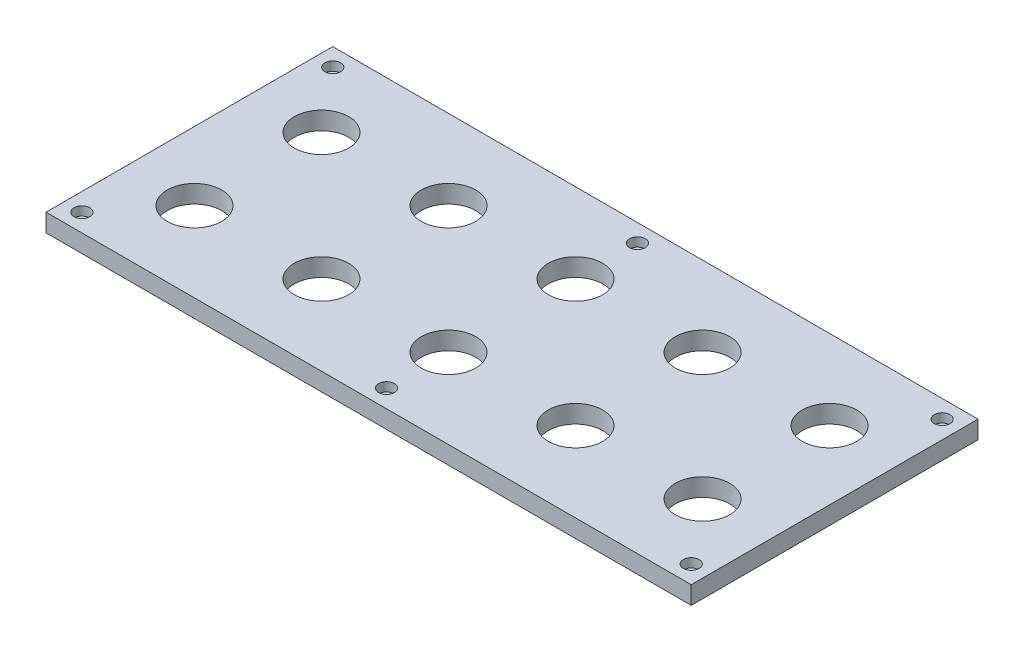
ISO-10303-21;
HEADER;
FILE_DESCRIPTION(('STEP AP214'),'2;1');
FILE_NAME('part.step','',(''),(''),'','','');
FILE_SCHEMA(('AUTOMOTIVE_DESIGN { 1 0 10303 214 1 1 1 1 }'));
ENDSEC;
DATA;
#1=APPLICATION_CONTEXT('core data for automotive mechanical design processes');
#2=APPLICATION_PROTOCOL_DEFINITION('international standard','automotive_design',2000,#1);
#3=PRODUCT_CONTEXT('',#1,'mechanical');
#4=PRODUCT('Part','Part','',(#3));
#5=PRODUCT_RELATED_PRODUCT_CATEGORY('part','',(#4));
#6=PRODUCT_DEFINITION_FORMATION('','',#4);
#7=PRODUCT_DEFINITION_CONTEXT('part definition',#1,'design');
#8=PRODUCT_DEFINITION('design','',#6,#7);
#9=PRODUCT_DEFINITION_SHAPE('','',#8);
#10=(LENGTH_UNIT() NAMED_UNIT(*) SI_UNIT(.MILLI.,.METRE.));
#11=(NAMED_UNIT(*) PLANE_ANGLE_UNIT() SI_UNIT($,.RADIAN.));
#12=(NAMED_UNIT(*) SI_UNIT($,.STERADIAN.) SOLID_ANGLE_UNIT());
#13=UNCERTAINTY_MEASURE_WITH_UNIT(LENGTH_MEASURE(1.E-05),#10,'distance_accuracy_value','');
#14=(GEOMETRIC_REPRESENTATION_CONTEXT(3) GLOBAL_UNCERTAINTY_ASSIGNED_CONTEXT((#13)) GLOBAL_UNIT_ASSIGNED_CONTEXT((#10,
#11,#12)) REPRESENTATION_CONTEXT('',''));
#15=CARTESIAN_POINT('',(0.,0.,0.));
#16=DIRECTION('',(0.,0.,1.));
#17=DIRECTION('',(1.,0.,0.));
#18=AXIS2_PLACEMENT_3D('',#15,#16,#17);
#19=CARTESIAN_POINT('',(0.,0.,0.));
#20=DIRECTION('',(0.,-1.,0.));
#21=DIRECTION('',(0.,0.,-1.));
#22=AXIS2_PLACEMENT_3D('',#19,#20,#21);
#23=PLANE('',#22);
#24=CARTESIAN_POINT('',(0.,0.,88.9));
#25=DIRECTION('',(0.,1.,0.));
#26=DIRECTION('',(0.,0.,1.));
#27=AXIS2_PLACEMENT_3D('',#24,#25,#26);
#28=CIRCLE('',#27,5.55625);
#29=CARTESIAN_POINT('',(0.,0.,94.45625));
#30=VERTEX_POINT('',#29);
#31=EDGE_CURVE('E258',#30,#30,#28,.T.);
#32=ORIENTED_EDGE('',*,*,#31,.F.);
#33=EDGE_LOOP('',(#32));
#34=FACE_BOUND('',#33,.T.);
#35=CARTESIAN_POINT('',(215.9,0.,-88.9));
#36=DIRECTION('',(0.,1.,0.));
#37=DIRECTION('',(0.,0.,1.));
#38=AXIS2_PLACEMENT_3D('',#35,#36,#37);
#39=CIRCLE('',#38,5.55624999999998);
#40=CARTESIAN_POINT('',(215.9,0.,-83.3437500000001));
#41=VERTEX_POINT('',#40);
#42=EDGE_CURVE('E282',#41,#41,#39,.T.);
#43=ORIENTED_EDGE('',*,*,#42,.F.);
#44=EDGE_LOOP('',(#43));
#45=FACE_BOUND('',#44,.T.);
#46=CARTESIAN_POINT('',(-215.9,0.,-88.9));
#47=DIRECTION('',(0.,1.,0.));
#48=DIRECTION('',(0.,0.,1.));
#49=AXIS2_PLACEMENT_3D('',#46,#47,#48);
#50=CIRCLE('',#49,5.55624999999998);
#51=CARTESIAN_POINT('',(-215.9,0.,-83.3437500000001));
#52=VERTEX_POINT('',#51);
#53=EDGE_CURVE('E306',#52,#52,#50,.T.);
#54=ORIENTED_EDGE('',*,*,#53,.F.);
#55=EDGE_LOOP('',(#54));
#56=FACE_BOUND('',#55,.T.);
#57=CARTESIAN_POINT('',(180.,0.,-45.));
#58=DIRECTION('',(0.,1.,0.));
#59=DIRECTION('',(0.,0.,1.));
#60=AXIS2_PLACEMENT_3D('',#57,#58,#59);
#61=CIRCLE('',#60,19.304);
#62=CARTESIAN_POINT('',(180.,0.,-25.696));
#63=VERTEX_POINT('',#62);
#64=EDGE_CURVE('E344',#63,#63,#61,.T.);
#65=ORIENTED_EDGE('',*,*,#64,.F.);
#66=EDGE_LOOP('',(#65));
#67=FACE_BOUND('',#66,.T.);
#68=CARTESIAN_POINT('',(90.,0.,-44.9999999999999));
#69=DIRECTION('',(0.,1.,0.));
#70=DIRECTION('',(0.,0.,1.));
#71=AXIS2_PLACEMENT_3D('',#68,#69,#70);
#72=CIRCLE('',#71,19.304);
#73=CARTESIAN_POINT('',(90.,0.,-25.6959999999999));
#74=VERTEX_POINT('',#73);
#75=EDGE_CURVE('E338',#74,#74,#72,.T.);
#76=ORIENTED_EDGE('',*,*,#75,.F.);
#77=EDGE_LOOP('',(#76));
#78=FACE_BOUND('',#77,.T.);
#79=CARTESIAN_POINT('',(90.,0.,45.));
#80=DIRECTION('',(0.,1.,0.));
#81=DIRECTION('',(0.,0.,1.));
#82=AXIS2_PLACEMENT_3D('',#79,#80,#81);
#83=CIRCLE('',#82,19.304);
#84=CARTESIAN_POINT('',(90.,0.,64.304));
#85=VERTEX_POINT('',#84);
#86=EDGE_CURVE('E332',#85,#85,#83,.T.);
#87=ORIENTED_EDGE('',*,*,#86,.F.);
#88=EDGE_LOOP('',(#87));
#89=FACE_BOUND('',#88,.T.);
#90=CARTESIAN_POINT('',(0.,0.,45.));
#91=DIRECTION('',(0.,1.,0.));
#92=DIRECTION('',(0.,0.,1.));
#93=AXIS2_PLACEMENT_3D('',#90,#91,#92);
#94=CIRCLE('',#93,19.304);
#95=CARTESIAN_POINT('',(0.,0.,64.304));
#96=VERTEX_POINT('',#95);
#97=EDGE_CURVE('E325',#96,#96,#94,.T.);
#98=ORIENTED_EDGE('',*,*,#97,.F.);
#99=EDGE_LOOP('',(#98));
#100=FACE_BOUND('',#99,.T.);
#101=CARTESIAN_POINT('',(-90.,0.,45.));
#102=DIRECTION('',(0.,1.,0.));
#103=DIRECTION('',(0.,0.,1.));
#104=AXIS2_PLACEMENT_3D('',#101,#102,#103);
#105=CIRCLE('',#104,19.304);
#106=CARTESIAN_POINT('',(-90.,0.,64.304));
#107=VERTEX_POINT('',#106);
#108=EDGE_CURVE('E368',#107,#107,#105,.T.);
#109=ORIENTED_EDGE('',*,*,#108,.F.);
#110=EDGE_LOOP('',(#109));
#111=FACE_BOUND('',#110,.T.);
#112=CARTESIAN_POINT('',(-180.,0.,45.));
#113=DIRECTION('',(0.,1.,0.));
#114=DIRECTION('',(0.,0.,1.));
#115=AXIS2_PLACEMENT_3D('',#112,#113,#114);
#116=CIRCLE('',#115,19.304);
#117=CARTESIAN_POINT('',(-180.,0.,64.304));
#118=VERTEX_POINT('',#117);
#119=EDGE_CURVE('E362',#118,#118,#116,.T.);
#120=ORIENTED_EDGE('',*,*,#119,.F.);
#121=EDGE_LOOP('',(#120));
#122=FACE_BOUND('',#121,.T.);
#123=CARTESIAN_POINT('',(0.,0.,-45.));
#124=DIRECTION('',(0.,1.,0.));
#125=DIRECTION('',(0.,0.,1.));
#126=AXIS2_PLACEMENT_3D('',#123,#124,#125);
#127=CIRCLE('',#126,19.304);
#128=CARTESIAN_POINT('',(0.,0.,-25.696));
#129=VERTEX_POINT('',#128);
#130=EDGE_CURVE('E356',#129,#129,#127,.T.);
#131=ORIENTED_EDGE('',*,*,#130,.F.);
#132=EDGE_LOOP('',(#131));
#133=FACE_BOUND('',#132,.T.);
#134=CARTESIAN_POINT('',(-90.,0.,-44.9999999999999));
#135=DIRECTION('',(0.,1.,0.));
#136=DIRECTION('',(0.,0.,1.));
#137=AXIS2_PLACEMENT_3D('',#134,#135,#136);
#138=CIRCLE('',#137,19.304);
#139=CARTESIAN_POINT('',(-90.,0.,-25.6959999999999));
#140=VERTEX_POINT('',#139);
#141=EDGE_CURVE('E349',#140,#140,#138,.T.);
#142=ORIENTED_EDGE('',*,*,#141,.F.);
#143=EDGE_LOOP('',(#142));
#144=FACE_BOUND('',#143,.T.);
#145=CARTESIAN_POINT('',(180.,0.,45.));
#146=DIRECTION('',(0.,1.,0.));
#147=DIRECTION('',(0.,0.,1.));
#148=AXIS2_PLACEMENT_3D('',#145,#146,#147);
#149=CIRCLE('',#148,19.304);
#150=CARTESIAN_POINT('',(180.,0.,64.304));
#151=VERTEX_POINT('',#150);
#152=EDGE_CURVE('E319',#151,#151,#149,.T.);
#153=ORIENTED_EDGE('',*,*,#152,.F.);
#154=EDGE_LOOP('',(#153));
#155=FACE_BOUND('',#154,.T.);
#156=CARTESIAN_POINT('',(-180.,0.,-45.));
#157=DIRECTION('',(0.,1.,0.));
#158=DIRECTION('',(0.,0.,1.));
#159=AXIS2_PLACEMENT_3D('',#156,#157,#158);
#160=CIRCLE('',#159,19.304);
#161=CARTESIAN_POINT('',(-180.,0.,-25.696));
#162=VERTEX_POINT('',#161);
#163=EDGE_CURVE('E102',#162,#162,#160,.T.);
#164=ORIENTED_EDGE('',*,*,#163,.F.);
#165=EDGE_LOOP('',(#164));
#166=FACE_BOUND('',#165,.T.);
#167=DIRECTION('',(0.,0.,1.));
#168=VECTOR('',#167,1.);
#169=CARTESIAN_POINT('',(-228.6,0.,-101.6));
#170=LINE('',#169,#168);
#171=CARTESIAN_POINT('',(-228.6,0.,-101.6));
#172=VERTEX_POINT('',#171);
#173=CARTESIAN_POINT('',(-228.6,0.,101.6));
#174=VERTEX_POINT('',#173);
#175=EDGE_CURVE('E98',#172,#174,#170,.T.);
#176=ORIENTED_EDGE('',*,*,#175,.T.);
#177=DIRECTION('',(1.,0.,0.));
#178=VECTOR('',#177,1.);
#179=CARTESIAN_POINT('',(228.6,0.,101.6));
#180=LINE('',#179,#178);
#181=CARTESIAN_POINT('',(228.6,0.,101.6));
#182=VERTEX_POINT('',#181);
#183=EDGE_CURVE('E101',#174,#182,#180,.T.);
#184=ORIENTED_EDGE('',*,*,#183,.T.);
#185=DIRECTION('',(0.,0.,-1.));
#186=VECTOR('',#185,1.);
#187=CARTESIAN_POINT('',(228.6,0.,-101.6));
#188=LINE('',#187,#186);
#189=CARTESIAN_POINT('',(228.6,0.,-101.6));
#190=VERTEX_POINT('',#189);
#191=EDGE_CURVE('E83',#182,#190,#188,.T.);
#192=ORIENTED_EDGE('',*,*,#191,.T.);
#193=DIRECTION('',(-1.,0.,0.));
#194=VECTOR('',#193,1.);
#195=CARTESIAN_POINT('',(228.6,0.,-101.6));
#196=LINE('',#195,#194);
#197=EDGE_CURVE('E93',#190,#172,#196,.T.);
#198=ORIENTED_EDGE('',*,*,#197,.T.);
#199=EDGE_LOOP('',(#176,#184,#192,#198));
#200=FACE_BOUND('',#199,.T.);
#201=CARTESIAN_POINT('',(0.,0.,-88.8999999999999));
#202=DIRECTION('',(0.,1.,0.));
#203=DIRECTION('',(0.,0.,1.));
#204=AXIS2_PLACEMENT_3D('',#201,#202,#203);
#205=CIRCLE('',#204,5.55625);
#206=CARTESIAN_POINT('',(0.,0.,-83.34375));
#207=VERTEX_POINT('',#206);
#208=EDGE_CURVE('E294',#207,#207,#205,.T.);
#209=ORIENTED_EDGE('',*,*,#208,.F.);
#210=EDGE_LOOP('',(#209));
#211=FACE_BOUND('',#210,.T.);
#212=CARTESIAN_POINT('',(215.9,0.,88.9));
#213=DIRECTION('',(0.,1.,0.));
#214=DIRECTION('',(0.,0.,1.));
#215=AXIS2_PLACEMENT_3D('',#212,#213,#214);
#216=CIRCLE('',#215,5.55624999999998);
#217=CARTESIAN_POINT('',(215.9,0.,94.45625));
#218=VERTEX_POINT('',#217);
#219=EDGE_CURVE('E270',#218,#218,#216,.T.);
#220=ORIENTED_EDGE('',*,*,#219,.F.);
#221=EDGE_LOOP('',(#220));
#222=FACE_BOUND('',#221,.T.);
#223=CARTESIAN_POINT('',(-215.9,0.,88.9));
#224=DIRECTION('',(0.,1.,0.));
#225=DIRECTION('',(0.,0.,1.));
#226=AXIS2_PLACEMENT_3D('',#223,#224,#225);
#227=CIRCLE('',#226,5.55624999999998);
#228=CARTESIAN_POINT('',(-215.9,0.,94.45625));
#229=VERTEX_POINT('',#228);
#230=EDGE_CURVE('E247',#229,#229,#227,.T.);
#231=ORIENTED_EDGE('',*,*,#230,.F.);
#232=EDGE_LOOP('',(#231));
#233=FACE_BOUND('',#232,.T.);
#234=ADVANCED_FACE('F32',(#34,#45,#56,#67,#78,#89,#100,#111,#122,#133,#144,#155,#166,#200,#211,
#222,#233),#23,.F.);
#235=CARTESIAN_POINT('',(-228.6,-12.7,-101.6));
#236=DIRECTION('',(-1.,0.,0.));
#237=DIRECTION('',(0.,0.,1.));
#238=AXIS2_PLACEMENT_3D('',#235,#236,#237);
#239=PLANE('',#238);
#240=ORIENTED_EDGE('',*,*,#175,.F.);
#241=DIRECTION('',(0.,1.,0.));
#242=VECTOR('',#241,1.);
#243=CARTESIAN_POINT('',(-228.6,-12.7,-101.6));
#244=LINE('',#243,#242);
#245=CARTESIAN_POINT('',(-228.6,-12.7,-101.6));
#246=VERTEX_POINT('',#245);
#247=EDGE_CURVE('E11',#246,#172,#244,.T.);
#248=ORIENTED_EDGE('',*,*,#247,.F.);
#249=DIRECTION('',(0.,0.,1.));
#250=VECTOR('',#249,1.);
#251=CARTESIAN_POINT('',(-228.6,-12.7,-101.6));
#252=LINE('',#251,#250);
#253=CARTESIAN_POINT('',(-228.6,-12.7,101.6));
#254=VERTEX_POINT('',#253);
#255=EDGE_CURVE('E91',#246,#254,#252,.T.);
#256=ORIENTED_EDGE('',*,*,#255,.T.);
#257=DIRECTION('',(0.,1.,0.));
#258=VECTOR('',#257,1.);
#259=CARTESIAN_POINT('',(-228.6,-12.7,101.6));
#260=LINE('',#259,#258);
#261=EDGE_CURVE('E36',#254,#174,#260,.T.);
#262=ORIENTED_EDGE('',*,*,#261,.T.);
#263=EDGE_LOOP('',(#240,#248,#256,#262));
#264=FACE_BOUND('',#263,.T.);
#265=ADVANCED_FACE('F34',(#264),#239,.T.);
#266=CARTESIAN_POINT('',(228.6,-12.7,-101.6));
#267=DIRECTION('',(0.,0.,-1.));
#268=DIRECTION('',(-1.,0.,0.));
#269=AXIS2_PLACEMENT_3D('',#266,#267,#268);
#270=PLANE('',#269);
#271=ORIENTED_EDGE('',*,*,#197,.F.);
#272=DIRECTION('',(0.,1.,0.));
#273=VECTOR('',#272,1.);
#274=CARTESIAN_POINT('',(228.6,-12.7,-101.6));
#275=LINE('',#274,#273);
#276=CARTESIAN_POINT('',(228.6,-12.7,-101.6));
#277=VERTEX_POINT('',#276);
#278=EDGE_CURVE('E42',#277,#190,#275,.T.);
#279=ORIENTED_EDGE('',*,*,#278,.F.);
#280=DIRECTION('',(-1.,0.,0.));
#281=VECTOR('',#280,1.);
#282=CARTESIAN_POINT('',(228.6,-12.7,-101.6));
#283=LINE('',#282,#281);
#284=EDGE_CURVE('E88',#277,#246,#283,.T.);
#285=ORIENTED_EDGE('',*,*,#284,.T.);
#286=ORIENTED_EDGE('',*,*,#247,.T.);
#287=EDGE_LOOP('',(#271,#279,#285,#286));
#288=FACE_BOUND('',#287,.T.);
#289=ADVANCED_FACE('F109',(#288),#270,.T.);
#290=CARTESIAN_POINT('',(228.6,-12.7,-101.6));
#291=DIRECTION('',(1.,0.,0.));
#292=DIRECTION('',(0.,0.,-1.));
#293=AXIS2_PLACEMENT_3D('',#290,#291,#292);
#294=PLANE('',#293);
#295=ORIENTED_EDGE('',*,*,#191,.F.);
#296=DIRECTION('',(0.,1.,0.));
#297=VECTOR('',#296,1.);
#298=CARTESIAN_POINT('',(228.6,-12.7,101.6));
#299=LINE('',#298,#297);
#300=CARTESIAN_POINT('',(228.6,-12.7,101.6));
#301=VERTEX_POINT('',#300);
#302=EDGE_CURVE('E78',#301,#182,#299,.T.);
#303=ORIENTED_EDGE('',*,*,#302,.F.);
#304=DIRECTION('',(0.,0.,-1.));
#305=VECTOR('',#304,1.);
#306=CARTESIAN_POINT('',(228.6,-12.7,-101.6));
#307=LINE('',#306,#305);
#308=EDGE_CURVE('E81',#301,#277,#307,.T.);
#309=ORIENTED_EDGE('',*,*,#308,.T.);
#310=ORIENTED_EDGE('',*,*,#278,.T.);
#311=EDGE_LOOP('',(#295,#303,#309,#310));
#312=FACE_BOUND('',#311,.T.);
#313=ADVANCED_FACE('F80',(#312),#294,.T.);
#314=CARTESIAN_POINT('',(228.6,-12.7,101.6));
#315=DIRECTION('',(0.,0.,1.));
#316=DIRECTION('',(1.,0.,0.));
#317=AXIS2_PLACEMENT_3D('',#314,#315,#316);
#318=PLANE('',#317);
#319=ORIENTED_EDGE('',*,*,#183,.F.);
#320=ORIENTED_EDGE('',*,*,#261,.F.);
#321=DIRECTION('',(1.,0.,0.));
#322=VECTOR('',#321,1.);
#323=CARTESIAN_POINT('',(228.6,-12.7,101.6));
#324=LINE('',#323,#322);
#325=EDGE_CURVE('E87',#254,#301,#324,.T.);
#326=ORIENTED_EDGE('',*,*,#325,.T.);
#327=ORIENTED_EDGE('',*,*,#302,.T.);
#328=EDGE_LOOP('',(#319,#320,#326,#327));
#329=FACE_BOUND('',#328,.T.);
#330=ADVANCED_FACE('F90',(#329),#318,.T.);
#331=CARTESIAN_POINT('',(0.,-12.7,0.));
#332=DIRECTION('',(0.,-1.,0.));
#333=DIRECTION('',(0.,0.,-1.));
#334=AXIS2_PLACEMENT_3D('',#331,#332,#333);
#335=PLANE('',#334);
#336=CARTESIAN_POINT('',(-215.9,-12.7,88.9));
#337=DIRECTION('',(0.,-1.,0.));
#338=DIRECTION('',(0.,0.,-1.));
#339=AXIS2_PLACEMENT_3D('',#336,#337,#338);
#340=CIRCLE('',#339,3.3782);
#341=CARTESIAN_POINT('',(-215.9,-12.7,85.5218));
#342=VERTEX_POINT('',#341);
#343=EDGE_CURVE('E255',#342,#342,#340,.T.);
#344=ORIENTED_EDGE('',*,*,#343,.F.);
#345=EDGE_LOOP('',(#344));
#346=FACE_BOUND('',#345,.T.);
#347=CARTESIAN_POINT('',(0.,-12.7,88.9));
#348=DIRECTION('',(0.,-1.,0.));
#349=DIRECTION('',(0.,0.,-1.));
#350=AXIS2_PLACEMENT_3D('',#347,#348,#349);
#351=CIRCLE('',#350,3.3782);
#352=CARTESIAN_POINT('',(0.,-12.7,85.5218));
#353=VERTEX_POINT('',#352);
#354=EDGE_CURVE('E267',#353,#353,#351,.T.);
#355=ORIENTED_EDGE('',*,*,#354,.F.);
#356=EDGE_LOOP('',(#355));
#357=FACE_BOUND('',#356,.T.);
#358=CARTESIAN_POINT('',(215.9,-12.7,88.9));
#359=DIRECTION('',(0.,-1.,0.));
#360=DIRECTION('',(0.,0.,-1.));
#361=AXIS2_PLACEMENT_3D('',#358,#359,#360);
#362=CIRCLE('',#361,3.3782);
#363=CARTESIAN_POINT('',(215.9,-12.7,85.5218));
#364=VERTEX_POINT('',#363);
#365=EDGE_CURVE('E279',#364,#364,#362,.T.);
#366=ORIENTED_EDGE('',*,*,#365,.F.);
#367=EDGE_LOOP('',(#366));
#368=FACE_BOUND('',#367,.T.);
#369=CARTESIAN_POINT('',(215.9,-12.7,-88.9));
#370=DIRECTION('',(0.,-1.,0.));
#371=DIRECTION('',(0.,0.,-1.));
#372=AXIS2_PLACEMENT_3D('',#369,#370,#371);
#373=CIRCLE('',#372,3.3782);
#374=CARTESIAN_POINT('',(215.9,-12.7,-92.2782));
#375=VERTEX_POINT('',#374);
#376=EDGE_CURVE('E291',#375,#375,#373,.T.);
#377=ORIENTED_EDGE('',*,*,#376,.F.);
#378=EDGE_LOOP('',(#377));
#379=FACE_BOUND('',#378,.T.);
#380=CARTESIAN_POINT('',(0.,-12.7,-88.8999999999999));
#381=DIRECTION('',(0.,-1.,0.));
#382=DIRECTION('',(0.,0.,-1.));
#383=AXIS2_PLACEMENT_3D('',#380,#381,#382);
#384=CIRCLE('',#383,3.3782);
#385=CARTESIAN_POINT('',(0.,-12.7,-92.2782));
#386=VERTEX_POINT('',#385);
#387=EDGE_CURVE('E303',#386,#386,#384,.T.);
#388=ORIENTED_EDGE('',*,*,#387,.F.);
#389=EDGE_LOOP('',(#388));
#390=FACE_BOUND('',#389,.T.);
#391=CARTESIAN_POINT('',(-215.9,-12.7,-88.9));
#392=DIRECTION('',(0.,-1.,0.));
#393=DIRECTION('',(0.,0.,-1.));
#394=AXIS2_PLACEMENT_3D('',#391,#392,#393);
#395=CIRCLE('',#394,3.3782);
#396=CARTESIAN_POINT('',(-215.9,-12.7,-92.2782));
#397=VERTEX_POINT('',#396);
#398=EDGE_CURVE('E315',#397,#397,#395,.T.);
#399=ORIENTED_EDGE('',*,*,#398,.F.);
#400=EDGE_LOOP('',(#399));
#401=FACE_BOUND('',#400,.T.);
#402=CARTESIAN_POINT('',(180.,-12.7,-45.));
#403=DIRECTION('',(0.,-1.,0.));
#404=DIRECTION('',(0.,0.,-1.));
#405=AXIS2_PLACEMENT_3D('',#402,#403,#404);
#406=CIRCLE('',#405,19.304);
#407=CARTESIAN_POINT('',(180.,-12.7,-64.304));
#408=VERTEX_POINT('',#407);
#409=EDGE_CURVE('E322',#408,#408,#406,.F.);
#410=ORIENTED_EDGE('',*,*,#409,.T.);
#411=EDGE_LOOP('',(#410));
#412=FACE_BOUND('',#411,.T.);
#413=CARTESIAN_POINT('',(90.,-12.7,-44.9999999999999));
#414=DIRECTION('',(0.,-1.,0.));
#415=DIRECTION('',(0.,0.,-1.));
#416=AXIS2_PLACEMENT_3D('',#413,#414,#415);
#417=CIRCLE('',#416,19.304);
#418=CARTESIAN_POINT('',(90.,-12.7,-64.3039999999999));
#419=VERTEX_POINT('',#418);
#420=EDGE_CURVE('E341',#419,#419,#417,.F.);
#421=ORIENTED_EDGE('',*,*,#420,.T.);
#422=EDGE_LOOP('',(#421));
#423=FACE_BOUND('',#422,.T.);
#424=CARTESIAN_POINT('',(90.,-12.7,45.));
#425=DIRECTION('',(0.,-1.,0.));
#426=DIRECTION('',(0.,0.,-1.));
#427=AXIS2_PLACEMENT_3D('',#424,#425,#426);
#428=CIRCLE('',#427,19.304);
#429=CARTESIAN_POINT('',(90.,-12.7,25.696));
#430=VERTEX_POINT('',#429);
#431=EDGE_CURVE('E335',#430,#430,#428,.F.);
#432=ORIENTED_EDGE('',*,*,#431,.T.);
#433=EDGE_LOOP('',(#432));
#434=FACE_BOUND('',#433,.T.);
#435=CARTESIAN_POINT('',(0.,-12.7,45.));
#436=DIRECTION('',(0.,-1.,0.));
#437=DIRECTION('',(0.,0.,-1.));
#438=AXIS2_PLACEMENT_3D('',#435,#436,#437);
#439=CIRCLE('',#438,19.304);
#440=CARTESIAN_POINT('',(0.,-12.7,25.696));
#441=VERTEX_POINT('',#440);
#442=EDGE_CURVE('E329',#441,#441,#439,.F.);
#443=ORIENTED_EDGE('',*,*,#442,.T.);
#444=EDGE_LOOP('',(#443));
#445=FACE_BOUND('',#444,.T.);
#446=CARTESIAN_POINT('',(-90.,-12.7,45.));
#447=DIRECTION('',(0.,-1.,0.));
#448=DIRECTION('',(0.,0.,-1.));
#449=AXIS2_PLACEMENT_3D('',#446,#447,#448);
#450=CIRCLE('',#449,19.304);
#451=CARTESIAN_POINT('',(-90.,-12.7,25.696));
#452=VERTEX_POINT('',#451);
#453=EDGE_CURVE('E328',#452,#452,#450,.F.);
#454=ORIENTED_EDGE('',*,*,#453,.T.);
#455=EDGE_LOOP('',(#454));
#456=FACE_BOUND('',#455,.T.);
#457=CARTESIAN_POINT('',(-180.,-12.7,45.));
#458=DIRECTION('',(0.,-1.,0.));
#459=DIRECTION('',(0.,0.,-1.));
#460=AXIS2_PLACEMENT_3D('',#457,#458,#459);
#461=CIRCLE('',#460,19.304);
#462=CARTESIAN_POINT('',(-180.,-12.7,25.696));
#463=VERTEX_POINT('',#462);
#464=EDGE_CURVE('E365',#463,#463,#461,.F.);
#465=ORIENTED_EDGE('',*,*,#464,.T.);
#466=EDGE_LOOP('',(#465));
#467=FACE_BOUND('',#466,.T.);
#468=CARTESIAN_POINT('',(0.,-12.7,-45.));
#469=DIRECTION('',(0.,-1.,0.));
#470=DIRECTION('',(0.,0.,-1.));
#471=AXIS2_PLACEMENT_3D('',#468,#469,#470);
#472=CIRCLE('',#471,19.304);
#473=CARTESIAN_POINT('',(0.,-12.7,-64.304));
#474=VERTEX_POINT('',#473);
#475=EDGE_CURVE('E359',#474,#474,#472,.F.);
#476=ORIENTED_EDGE('',*,*,#475,.T.);
#477=EDGE_LOOP('',(#476));
#478=FACE_BOUND('',#477,.T.);
#479=CARTESIAN_POINT('',(-90.,-12.7,-44.9999999999999));
#480=DIRECTION('',(0.,-1.,0.));
#481=DIRECTION('',(0.,0.,-1.));
#482=AXIS2_PLACEMENT_3D('',#479,#480,#481);
#483=CIRCLE('',#482,19.304);
#484=CARTESIAN_POINT('',(-90.,-12.7,-64.3039999999999));
#485=VERTEX_POINT('',#484);
#486=EDGE_CURVE('E353',#485,#485,#483,.F.);
#487=ORIENTED_EDGE('',*,*,#486,.T.);
#488=EDGE_LOOP('',(#487));
#489=FACE_BOUND('',#488,.T.);
#490=CARTESIAN_POINT('',(180.,-12.7,45.));
#491=DIRECTION('',(0.,-1.,0.));
#492=DIRECTION('',(0.,0.,-1.));
#493=AXIS2_PLACEMENT_3D('',#490,#491,#492);
#494=CIRCLE('',#493,19.304);
#495=CARTESIAN_POINT('',(180.,-12.7,25.696));
#496=VERTEX_POINT('',#495);
#497=EDGE_CURVE('E318',#496,#496,#494,.F.);
#498=ORIENTED_EDGE('',*,*,#497,.T.);
#499=EDGE_LOOP('',(#498));
#500=FACE_BOUND('',#499,.T.);
#501=CARTESIAN_POINT('',(-180.,-12.7,-45.));
#502=DIRECTION('',(0.,-1.,0.));
#503=DIRECTION('',(0.,0.,-1.));
#504=AXIS2_PLACEMENT_3D('',#501,#502,#503);
#505=CIRCLE('',#504,19.304);
#506=CARTESIAN_POINT('',(-180.,-12.7,-64.304));
#507=VERTEX_POINT('',#506);
#508=EDGE_CURVE('E352',#507,#507,#505,.F.);
#509=ORIENTED_EDGE('',*,*,#508,.T.);
#510=EDGE_LOOP('',(#509));
#511=FACE_BOUND('',#510,.T.);
#512=ORIENTED_EDGE('',*,*,#255,.F.);
#513=ORIENTED_EDGE('',*,*,#284,.F.);
#514=ORIENTED_EDGE('',*,*,#308,.F.);
#515=ORIENTED_EDGE('',*,*,#325,.F.);
#516=EDGE_LOOP('',(#512,#513,#514,#515));
#517=FACE_BOUND('',#516,.T.);
#518=ADVANCED_FACE('F86',(#346,#357,#368,#379,#390,#401,#412,#423,#434,#445,#456,#467,#478,#489,
#500,#511,#517),#335,.T.);
#519=CARTESIAN_POINT('',(-180.,-12.701,-45.));
#520=DIRECTION('',(0.,1.,0.));
#521=DIRECTION('',(0.,0.,1.));
#522=AXIS2_PLACEMENT_3D('',#519,#520,#521);
#523=CYLINDRICAL_SURFACE('',#522,19.304);
#524=ORIENTED_EDGE('',*,*,#508,.F.);
#525=EDGE_LOOP('',(#524));
#526=FACE_BOUND('',#525,.T.);
#527=ORIENTED_EDGE('',*,*,#163,.T.);
#528=EDGE_LOOP('',(#527));
#529=FACE_BOUND('',#528,.T.);
#530=ADVANCED_FACE('F127',(#526,#529),#523,.F.);
#531=CARTESIAN_POINT('',(180.,-12.701,45.));
#532=DIRECTION('',(0.,1.,0.));
#533=DIRECTION('',(0.,0.,1.));
#534=AXIS2_PLACEMENT_3D('',#531,#532,#533);
#535=CYLINDRICAL_SURFACE('',#534,19.304);
#536=ORIENTED_EDGE('',*,*,#497,.F.);
#537=EDGE_LOOP('',(#536));
#538=FACE_BOUND('',#537,.T.);
#539=ORIENTED_EDGE('',*,*,#152,.T.);
#540=EDGE_LOOP('',(#539));
#541=FACE_BOUND('',#540,.T.);
#542=ADVANCED_FACE('F131',(#538,#541),#535,.F.);
#543=CARTESIAN_POINT('',(-90.,-12.701,-44.9999999999999));
#544=DIRECTION('',(0.,1.,0.));
#545=DIRECTION('',(0.,0.,1.));
#546=AXIS2_PLACEMENT_3D('',#543,#544,#545);
#547=CYLINDRICAL_SURFACE('',#546,19.304);
#548=ORIENTED_EDGE('',*,*,#486,.F.);
#549=EDGE_LOOP('',(#548));
#550=FACE_BOUND('',#549,.T.);
#551=ORIENTED_EDGE('',*,*,#141,.T.);
#552=EDGE_LOOP('',(#551));
#553=FACE_BOUND('',#552,.T.);
#554=ADVANCED_FACE('F145',(#550,#553),#547,.F.);
#555=CARTESIAN_POINT('',(0.,-12.701,-45.));
#556=DIRECTION('',(0.,1.,0.));
#557=DIRECTION('',(0.,0.,1.));
#558=AXIS2_PLACEMENT_3D('',#555,#556,#557);
#559=CYLINDRICAL_SURFACE('',#558,19.304);
#560=ORIENTED_EDGE('',*,*,#475,.F.);
#561=EDGE_LOOP('',(#560));
#562=FACE_BOUND('',#561,.T.);
#563=ORIENTED_EDGE('',*,*,#130,.T.);
#564=EDGE_LOOP('',(#563));
#565=FACE_BOUND('',#564,.T.);
#566=ADVANCED_FACE('F141',(#562,#565),#559,.F.);
#567=CARTESIAN_POINT('',(-180.,-12.701,45.));
#568=DIRECTION('',(0.,1.,0.));
#569=DIRECTION('',(0.,0.,1.));
#570=AXIS2_PLACEMENT_3D('',#567,#568,#569);
#571=CYLINDRICAL_SURFACE('',#570,19.304);
#572=ORIENTED_EDGE('',*,*,#464,.F.);
#573=EDGE_LOOP('',(#572));
#574=FACE_BOUND('',#573,.T.);
#575=ORIENTED_EDGE('',*,*,#119,.T.);
#576=EDGE_LOOP('',(#575));
#577=FACE_BOUND('',#576,.T.);
#578=ADVANCED_FACE('F137',(#574,#577),#571,.F.);
#579=CARTESIAN_POINT('',(-90.,-12.701,45.));
#580=DIRECTION('',(0.,1.,0.));
#581=DIRECTION('',(0.,0.,1.));
#582=AXIS2_PLACEMENT_3D('',#579,#580,#581);
#583=CYLINDRICAL_SURFACE('',#582,19.304);
#584=ORIENTED_EDGE('',*,*,#453,.F.);
#585=EDGE_LOOP('',(#584));
#586=FACE_BOUND('',#585,.T.);
#587=ORIENTED_EDGE('',*,*,#108,.T.);
#588=EDGE_LOOP('',(#587));
#589=FACE_BOUND('',#588,.T.);
#590=ADVANCED_FACE('F133',(#586,#589),#583,.F.);
#591=CARTESIAN_POINT('',(0.,-12.701,45.));
#592=DIRECTION('',(0.,1.,0.));
#593=DIRECTION('',(0.,0.,1.));
#594=AXIS2_PLACEMENT_3D('',#591,#592,#593);
#595=CYLINDRICAL_SURFACE('',#594,19.304);
#596=ORIENTED_EDGE('',*,*,#442,.F.);
#597=EDGE_LOOP('',(#596));
#598=FACE_BOUND('',#597,.T.);
#599=ORIENTED_EDGE('',*,*,#97,.T.);
#600=EDGE_LOOP('',(#599));
#601=FACE_BOUND('',#600,.T.);
#602=ADVANCED_FACE('F136',(#598,#601),#595,.F.);
#603=CARTESIAN_POINT('',(90.,-12.701,45.));
#604=DIRECTION('',(0.,1.,0.));
#605=DIRECTION('',(0.,0.,1.));
#606=AXIS2_PLACEMENT_3D('',#603,#604,#605);
#607=CYLINDRICAL_SURFACE('',#606,19.304);
#608=ORIENTED_EDGE('',*,*,#431,.F.);
#609=EDGE_LOOP('',(#608));
#610=FACE_BOUND('',#609,.T.);
#611=ORIENTED_EDGE('',*,*,#86,.T.);
#612=EDGE_LOOP('',(#611));
#613=FACE_BOUND('',#612,.T.);
#614=ADVANCED_FACE('F158',(#610,#613),#607,.F.);
#615=CARTESIAN_POINT('',(90.,-12.701,-44.9999999999999));
#616=DIRECTION('',(0.,1.,0.));
#617=DIRECTION('',(0.,0.,1.));
#618=AXIS2_PLACEMENT_3D('',#615,#616,#617);
#619=CYLINDRICAL_SURFACE('',#618,19.304);
#620=ORIENTED_EDGE('',*,*,#420,.F.);
#621=EDGE_LOOP('',(#620));
#622=FACE_BOUND('',#621,.T.);
#623=ORIENTED_EDGE('',*,*,#75,.T.);
#624=EDGE_LOOP('',(#623));
#625=FACE_BOUND('',#624,.T.);
#626=ADVANCED_FACE('F154',(#622,#625),#619,.F.);
#627=CARTESIAN_POINT('',(180.,-12.701,-45.));
#628=DIRECTION('',(0.,1.,0.));
#629=DIRECTION('',(0.,0.,1.));
#630=AXIS2_PLACEMENT_3D('',#627,#628,#629);
#631=CYLINDRICAL_SURFACE('',#630,19.304);
#632=ORIENTED_EDGE('',*,*,#409,.F.);
#633=EDGE_LOOP('',(#632));
#634=FACE_BOUND('',#633,.T.);
#635=ORIENTED_EDGE('',*,*,#64,.T.);
#636=EDGE_LOOP('',(#635));
#637=FACE_BOUND('',#636,.T.);
#638=ADVANCED_FACE('F150',(#634,#637),#631,.F.);
#639=CARTESIAN_POINT('',(-215.9,0.,-88.9));
#640=DIRECTION('',(0.,1.,0.));
#641=DIRECTION('',(0.,0.,1.));
#642=AXIS2_PLACEMENT_3D('',#639,#640,#641);
#643=CYLINDRICAL_SURFACE('',#642,3.3782);
#644=CARTESIAN_POINT('',(-215.9,-6.35,-88.9));
#645=DIRECTION('',(0.,1.,0.));
#646=DIRECTION('',(0.,0.,1.));
#647=AXIS2_PLACEMENT_3D('',#644,#645,#646);
#648=CIRCLE('',#647,3.3782);
#649=CARTESIAN_POINT('',(-215.9,-6.35,-85.5218));
#650=VERTEX_POINT('',#649);
#651=EDGE_CURVE('E312',#650,#650,#648,.T.);
#652=ORIENTED_EDGE('',*,*,#651,.T.);
#653=EDGE_LOOP('',(#652));
#654=FACE_BOUND('',#653,.T.);
#655=ORIENTED_EDGE('',*,*,#398,.T.);
#656=EDGE_LOOP('',(#655));
#657=FACE_BOUND('',#656,.T.);
#658=ADVANCED_FACE('F153',(#654,#657),#643,.F.);
#659=CARTESIAN_POINT('',(-212.5218,-6.35,-88.9));
#660=DIRECTION('',(0.,-1.,0.));
#661=DIRECTION('',(0.,0.,-1.));
#662=AXIS2_PLACEMENT_3D('',#659,#660,#661);
#663=PLANE('',#662);
#664=ORIENTED_EDGE('',*,*,#651,.F.);
#665=EDGE_LOOP('',(#664));
#666=FACE_BOUND('',#665,.T.);
#667=CARTESIAN_POINT('',(-215.9,-6.35,-88.9));
#668=DIRECTION('',(0.,1.,0.));
#669=DIRECTION('',(0.,0.,1.));
#670=AXIS2_PLACEMENT_3D('',#667,#668,#669);
#671=CIRCLE('',#670,5.55624999999998);
#672=CARTESIAN_POINT('',(-215.9,-6.35,-83.3437500000001));
#673=VERTEX_POINT('',#672);
#674=EDGE_CURVE('E309',#673,#673,#671,.T.);
#675=ORIENTED_EDGE('',*,*,#674,.T.);
#676=EDGE_LOOP('',(#675));
#677=FACE_BOUND('',#676,.T.);
#678=ADVANCED_FACE('F171',(#666,#677),#663,.F.);
#679=CARTESIAN_POINT('',(-215.9,0.,-88.9));
#680=DIRECTION('',(0.,1.,0.));
#681=DIRECTION('',(0.,0.,1.));
#682=AXIS2_PLACEMENT_3D('',#679,#680,#681);
#683=CYLINDRICAL_SURFACE('',#682,5.55624999999998);
#684=ORIENTED_EDGE('',*,*,#674,.F.);
#685=EDGE_LOOP('',(#684));
#686=FACE_BOUND('',#685,.T.);
#687=ORIENTED_EDGE('',*,*,#53,.T.);
#688=EDGE_LOOP('',(#687));
#689=FACE_BOUND('',#688,.T.);
#690=ADVANCED_FACE('F175',(#686,#689),#683,.F.);
#691=CARTESIAN_POINT('',(0.,0.,-88.8999999999999));
#692=DIRECTION('',(0.,1.,0.));
#693=DIRECTION('',(0.,0.,1.));
#694=AXIS2_PLACEMENT_3D('',#691,#692,#693);
#695=CYLINDRICAL_SURFACE('',#694,3.3782);
#696=CARTESIAN_POINT('',(0.,-6.35,-88.8999999999999));
#697=DIRECTION('',(0.,1.,0.));
#698=DIRECTION('',(0.,0.,1.));
#699=AXIS2_PLACEMENT_3D('',#696,#697,#698);
#700=CIRCLE('',#699,3.3782);
#701=CARTESIAN_POINT('',(0.,-6.35,-85.5218));
#702=VERTEX_POINT('',#701);
#703=EDGE_CURVE('E300',#702,#702,#700,.T.);
#704=ORIENTED_EDGE('',*,*,#703,.T.);
#705=EDGE_LOOP('',(#704));
#706=FACE_BOUND('',#705,.T.);
#707=ORIENTED_EDGE('',*,*,#387,.T.);
#708=EDGE_LOOP('',(#707));
#709=FACE_BOUND('',#708,.T.);
#710=ADVANCED_FACE('F179',(#706,#709),#695,.F.);
#711=CARTESIAN_POINT('',(3.37819999999998,-6.35,-88.8999999999999));
#712=DIRECTION('',(0.,-1.,0.));
#713=DIRECTION('',(0.,0.,-1.));
#714=AXIS2_PLACEMENT_3D('',#711,#712,#713);
#715=PLANE('',#714);
#716=ORIENTED_EDGE('',*,*,#703,.F.);
#717=EDGE_LOOP('',(#716));
#718=FACE_BOUND('',#717,.T.);
#719=CARTESIAN_POINT('',(0.,-6.35,-88.8999999999999));
#720=DIRECTION('',(0.,1.,0.));
#721=DIRECTION('',(0.,0.,1.));
#722=AXIS2_PLACEMENT_3D('',#719,#720,#721);
#723=CIRCLE('',#722,5.55625);
#724=CARTESIAN_POINT('',(0.,-6.35,-83.34375));
#725=VERTEX_POINT('',#724);
#726=EDGE_CURVE('E297',#725,#725,#723,.T.);
#727=ORIENTED_EDGE('',*,*,#726,.T.);
#728=EDGE_LOOP('',(#727));
#729=FACE_BOUND('',#728,.T.);
#730=ADVANCED_FACE('F183',(#718,#729),#715,.F.);
#731=CARTESIAN_POINT('',(0.,0.,-88.8999999999999));
#732=DIRECTION('',(0.,1.,0.));
#733=DIRECTION('',(0.,0.,1.));
#734=AXIS2_PLACEMENT_3D('',#731,#732,#733);
#735=CYLINDRICAL_SURFACE('',#734,5.55625);
#736=ORIENTED_EDGE('',*,*,#726,.F.);
#737=EDGE_LOOP('',(#736));
#738=FACE_BOUND('',#737,.T.);
#739=ORIENTED_EDGE('',*,*,#208,.T.);
#740=EDGE_LOOP('',(#739));
#741=FACE_BOUND('',#740,.T.);
#742=ADVANCED_FACE('F187',(#738,#741),#735,.F.);
#743=CARTESIAN_POINT('',(215.9,0.,-88.9));
#744=DIRECTION('',(0.,1.,0.));
#745=DIRECTION('',(0.,0.,1.));
#746=AXIS2_PLACEMENT_3D('',#743,#744,#745);
#747=CYLINDRICAL_SURFACE('',#746,3.3782);
#748=CARTESIAN_POINT('',(215.9,-6.35,-88.9));
#749=DIRECTION('',(0.,1.,0.));
#750=DIRECTION('',(0.,0.,1.));
#751=AXIS2_PLACEMENT_3D('',#748,#749,#750);
#752=CIRCLE('',#751,3.3782);
#753=CARTESIAN_POINT('',(215.9,-6.35,-85.5218));
#754=VERTEX_POINT('',#753);
#755=EDGE_CURVE('E288',#754,#754,#752,.T.);
#756=ORIENTED_EDGE('',*,*,#755,.T.);
#757=EDGE_LOOP('',(#756));
#758=FACE_BOUND('',#757,.T.);
#759=ORIENTED_EDGE('',*,*,#376,.T.);
#760=EDGE_LOOP('',(#759));
#761=FACE_BOUND('',#760,.T.);
#762=ADVANCED_FACE('F191',(#758,#761),#747,.F.);
#763=CARTESIAN_POINT('',(219.2782,-6.35,-88.9));
#764=DIRECTION('',(0.,-1.,0.));
#765=DIRECTION('',(0.,0.,-1.));
#766=AXIS2_PLACEMENT_3D('',#763,#764,#765);
#767=PLANE('',#766);
#768=ORIENTED_EDGE('',*,*,#755,.F.);
#769=EDGE_LOOP('',(#768));
#770=FACE_BOUND('',#769,.T.);
#771=CARTESIAN_POINT('',(215.9,-6.35,-88.9));
#772=DIRECTION('',(0.,1.,0.));
#773=DIRECTION('',(0.,0.,1.));
#774=AXIS2_PLACEMENT_3D('',#771,#772,#773);
#775=CIRCLE('',#774,5.55624999999998);
#776=CARTESIAN_POINT('',(215.9,-6.35,-83.3437500000001));
#777=VERTEX_POINT('',#776);
#778=EDGE_CURVE('E285',#777,#777,#775,.T.);
#779=ORIENTED_EDGE('',*,*,#778,.T.);
#780=EDGE_LOOP('',(#779));
#781=FACE_BOUND('',#780,.T.);
#782=ADVANCED_FACE('F195',(#770,#781),#767,.F.);
#783=CARTESIAN_POINT('',(215.9,0.,-88.9));
#784=DIRECTION('',(0.,1.,0.));
#785=DIRECTION('',(0.,0.,1.));
#786=AXIS2_PLACEMENT_3D('',#783,#784,#785);
#787=CYLINDRICAL_SURFACE('',#786,5.55624999999998);
#788=ORIENTED_EDGE('',*,*,#778,.F.);
#789=EDGE_LOOP('',(#788));
#790=FACE_BOUND('',#789,.T.);
#791=ORIENTED_EDGE('',*,*,#42,.T.);
#792=EDGE_LOOP('',(#791));
#793=FACE_BOUND('',#792,.T.);
#794=ADVANCED_FACE('F199',(#790,#793),#787,.F.);
#795=CARTESIAN_POINT('',(215.9,0.,88.9));
#796=DIRECTION('',(0.,1.,0.));
#797=DIRECTION('',(0.,0.,1.));
#798=AXIS2_PLACEMENT_3D('',#795,#796,#797);
#799=CYLINDRICAL_SURFACE('',#798,3.3782);
#800=CARTESIAN_POINT('',(215.9,-6.35,88.9));
#801=DIRECTION('',(0.,1.,0.));
#802=DIRECTION('',(0.,0.,1.));
#803=AXIS2_PLACEMENT_3D('',#800,#801,#802);
#804=CIRCLE('',#803,3.3782);
#805=CARTESIAN_POINT('',(215.9,-6.35,92.2782));
#806=VERTEX_POINT('',#805);
#807=EDGE_CURVE('E276',#806,#806,#804,.T.);
#808=ORIENTED_EDGE('',*,*,#807,.T.);
#809=EDGE_LOOP('',(#808));
#810=FACE_BOUND('',#809,.T.);
#811=ORIENTED_EDGE('',*,*,#365,.T.);
#812=EDGE_LOOP('',(#811));
#813=FACE_BOUND('',#812,.T.);
#814=ADVANCED_FACE('F203',(#810,#813),#799,.F.);
#815=CARTESIAN_POINT('',(219.2782,-6.35,88.9));
#816=DIRECTION('',(0.,-1.,0.));
#817=DIRECTION('',(0.,0.,-1.));
#818=AXIS2_PLACEMENT_3D('',#815,#816,#817);
#819=PLANE('',#818);
#820=ORIENTED_EDGE('',*,*,#807,.F.);
#821=EDGE_LOOP('',(#820));
#822=FACE_BOUND('',#821,.T.);
#823=CARTESIAN_POINT('',(215.9,-6.35,88.9));
#824=DIRECTION('',(0.,1.,0.));
#825=DIRECTION('',(0.,0.,1.));
#826=AXIS2_PLACEMENT_3D('',#823,#824,#825);
#827=CIRCLE('',#826,5.55624999999998);
#828=CARTESIAN_POINT('',(215.9,-6.35,94.45625));
#829=VERTEX_POINT('',#828);
#830=EDGE_CURVE('E273',#829,#829,#827,.T.);
#831=ORIENTED_EDGE('',*,*,#830,.T.);
#832=EDGE_LOOP('',(#831));
#833=FACE_BOUND('',#832,.T.);
#834=ADVANCED_FACE('F207',(#822,#833),#819,.F.);
#835=CARTESIAN_POINT('',(215.9,0.,88.9));
#836=DIRECTION('',(0.,1.,0.));
#837=DIRECTION('',(0.,0.,1.));
#838=AXIS2_PLACEMENT_3D('',#835,#836,#837);
#839=CYLINDRICAL_SURFACE('',#838,5.55624999999998);
#840=ORIENTED_EDGE('',*,*,#830,.F.);
#841=EDGE_LOOP('',(#840));
#842=FACE_BOUND('',#841,.T.);
#843=ORIENTED_EDGE('',*,*,#219,.T.);
#844=EDGE_LOOP('',(#843));
#845=FACE_BOUND('',#844,.T.);
#846=ADVANCED_FACE('F211',(#842,#845),#839,.F.);
#847=CARTESIAN_POINT('',(0.,0.,88.9));
#848=DIRECTION('',(0.,1.,0.));
#849=DIRECTION('',(0.,0.,1.));
#850=AXIS2_PLACEMENT_3D('',#847,#848,#849);
#851=CYLINDRICAL_SURFACE('',#850,3.3782);
#852=CARTESIAN_POINT('',(0.,-6.35,88.9));
#853=DIRECTION('',(0.,1.,0.));
#854=DIRECTION('',(0.,0.,1.));
#855=AXIS2_PLACEMENT_3D('',#852,#853,#854);
#856=CIRCLE('',#855,3.3782);
#857=CARTESIAN_POINT('',(0.,-6.35,92.2782));
#858=VERTEX_POINT('',#857);
#859=EDGE_CURVE('E264',#858,#858,#856,.T.);
#860=ORIENTED_EDGE('',*,*,#859,.T.);
#861=EDGE_LOOP('',(#860));
#862=FACE_BOUND('',#861,.T.);
#863=ORIENTED_EDGE('',*,*,#354,.T.);
#864=EDGE_LOOP('',(#863));
#865=FACE_BOUND('',#864,.T.);
#866=ADVANCED_FACE('F215',(#862,#865),#851,.F.);
#867=CARTESIAN_POINT('',(3.3782,-6.35,88.9));
#868=DIRECTION('',(0.,-1.,0.));
#869=DIRECTION('',(0.,0.,-1.));
#870=AXIS2_PLACEMENT_3D('',#867,#868,#869);
#871=PLANE('',#870);
#872=ORIENTED_EDGE('',*,*,#859,.F.);
#873=EDGE_LOOP('',(#872));
#874=FACE_BOUND('',#873,.T.);
#875=CARTESIAN_POINT('',(0.,-6.35,88.9));
#876=DIRECTION('',(0.,1.,0.));
#877=DIRECTION('',(0.,0.,1.));
#878=AXIS2_PLACEMENT_3D('',#875,#876,#877);
#879=CIRCLE('',#878,5.55625);
#880=CARTESIAN_POINT('',(0.,-6.35,94.45625));
#881=VERTEX_POINT('',#880);
#882=EDGE_CURVE('E261',#881,#881,#879,.T.);
#883=ORIENTED_EDGE('',*,*,#882,.T.);
#884=EDGE_LOOP('',(#883));
#885=FACE_BOUND('',#884,.T.);
#886=ADVANCED_FACE('F219',(#874,#885),#871,.F.);
#887=CARTESIAN_POINT('',(0.,0.,88.9));
#888=DIRECTION('',(0.,1.,0.));
#889=DIRECTION('',(0.,0.,1.));
#890=AXIS2_PLACEMENT_3D('',#887,#888,#889);
#891=CYLINDRICAL_SURFACE('',#890,5.55625);
#892=ORIENTED_EDGE('',*,*,#882,.F.);
#893=EDGE_LOOP('',(#892));
#894=FACE_BOUND('',#893,.T.);
#895=ORIENTED_EDGE('',*,*,#31,.T.);
#896=EDGE_LOOP('',(#895));
#897=FACE_BOUND('',#896,.T.);
#898=ADVANCED_FACE('F223',(#894,#897),#891,.F.);
#899=CARTESIAN_POINT('',(-215.9,0.,88.9));
#900=DIRECTION('',(0.,1.,0.));
#901=DIRECTION('',(0.,0.,1.));
#902=AXIS2_PLACEMENT_3D('',#899,#900,#901);
#903=CYLINDRICAL_SURFACE('',#902,3.3782);
#904=CARTESIAN_POINT('',(-215.9,-6.35,88.9));
#905=DIRECTION('',(0.,1.,0.));
#906=DIRECTION('',(0.,0.,1.));
#907=AXIS2_PLACEMENT_3D('',#904,#905,#906);
#908=CIRCLE('',#907,3.3782);
#909=CARTESIAN_POINT('',(-215.9,-6.35,92.2782));
#910=VERTEX_POINT('',#909);
#911=EDGE_CURVE('E250',#910,#910,#908,.T.);
#912=ORIENTED_EDGE('',*,*,#911,.T.);
#913=EDGE_LOOP('',(#912));
#914=FACE_BOUND('',#913,.T.);
#915=ORIENTED_EDGE('',*,*,#343,.T.);
#916=EDGE_LOOP('',(#915));
#917=FACE_BOUND('',#916,.T.);
#918=ADVANCED_FACE('F227',(#914,#917),#903,.F.);
#919=CARTESIAN_POINT('',(-212.5218,-6.35,88.9));
#920=DIRECTION('',(0.,-1.,0.));
#921=DIRECTION('',(0.,0.,-1.));
#922=AXIS2_PLACEMENT_3D('',#919,#920,#921);
#923=PLANE('',#922);
#924=ORIENTED_EDGE('',*,*,#911,.F.);
#925=EDGE_LOOP('',(#924));
#926=FACE_BOUND('',#925,.T.);
#927=CARTESIAN_POINT('',(-215.9,-6.35,88.9));
#928=DIRECTION('',(0.,1.,0.));
#929=DIRECTION('',(0.,0.,1.));
#930=AXIS2_PLACEMENT_3D('',#927,#928,#929);
#931=CIRCLE('',#930,5.55624999999998);
#932=CARTESIAN_POINT('',(-215.9,-6.35,94.45625));
#933=VERTEX_POINT('',#932);
#934=EDGE_CURVE('E244',#933,#933,#931,.T.);
#935=ORIENTED_EDGE('',*,*,#934,.T.);
#936=EDGE_LOOP('',(#935));
#937=FACE_BOUND('',#936,.T.);
#938=ADVANCED_FACE('F231',(#926,#937),#923,.F.);
#939=CARTESIAN_POINT('',(-215.9,0.,88.9));
#940=DIRECTION('',(0.,1.,0.));
#941=DIRECTION('',(0.,0.,1.));
#942=AXIS2_PLACEMENT_3D('',#939,#940,#941);
#943=CYLINDRICAL_SURFACE('',#942,5.55624999999998);
#944=ORIENTED_EDGE('',*,*,#934,.F.);
#945=EDGE_LOOP('',(#944));
#946=FACE_BOUND('',#945,.T.);
#947=ORIENTED_EDGE('',*,*,#230,.T.);
#948=EDGE_LOOP('',(#947));
#949=FACE_BOUND('',#948,.T.);
#950=ADVANCED_FACE('F235',(#946,#949),#943,.F.);
#951=CLOSED_SHELL('',(#234,#265,#289,#313,#330,#518,#530,#542,#554,#566,#578,#590,#602,#614,
#626,#638,#658,#678,#690,#710,#730,#742,#762,#782,#794,#814,#834,#846,#866,#886,#898,#918,#938,#950));
#952=MANIFOLD_SOLID_BREP('B2',#951);
#953=ADVANCED_BREP_SHAPE_REPRESENTATION('',(#18,#952),#14);
#954=SHAPE_DEFINITION_REPRESENTATION(#9,#953);
ENDSEC;
END-ISO-10303-21;
